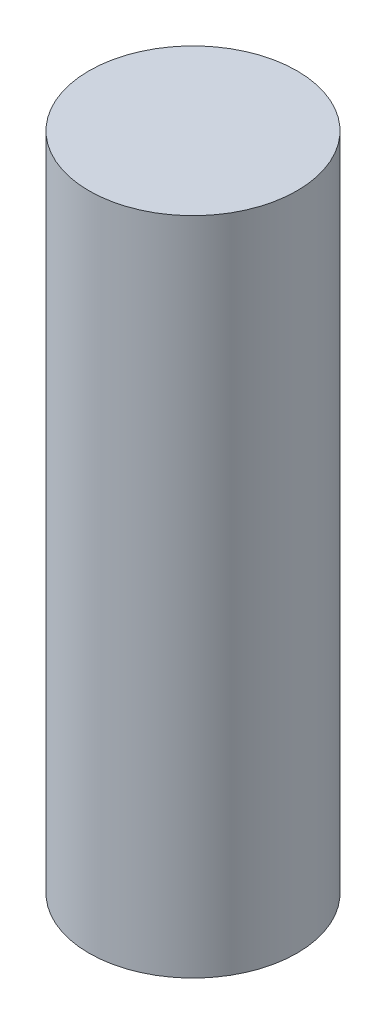
ISO-10303-21;
HEADER;
FILE_DESCRIPTION(('STEP AP214'),'2;1');
FILE_NAME('part.step','',(''),(''),'','','');
FILE_SCHEMA(('AUTOMOTIVE_DESIGN { 1 0 10303 214 1 1 1 1 }'));
ENDSEC;
DATA;
#1=APPLICATION_CONTEXT('core data for automotive mechanical design processes');
#2=APPLICATION_PROTOCOL_DEFINITION('international standard','automotive_design',2000,#1);
#3=PRODUCT_CONTEXT('',#1,'mechanical');
#4=PRODUCT('Part','Part','',(#3));
#5=PRODUCT_RELATED_PRODUCT_CATEGORY('part','',(#4));
#6=PRODUCT_DEFINITION_FORMATION('','',#4);
#7=PRODUCT_DEFINITION_CONTEXT('part definition',#1,'design');
#8=PRODUCT_DEFINITION('design','',#6,#7);
#9=PRODUCT_DEFINITION_SHAPE('','',#8);
#10=(LENGTH_UNIT() NAMED_UNIT(*) SI_UNIT(.MILLI.,.METRE.));
#11=(NAMED_UNIT(*) PLANE_ANGLE_UNIT() SI_UNIT($,.RADIAN.));
#12=(NAMED_UNIT(*) SI_UNIT($,.STERADIAN.) SOLID_ANGLE_UNIT());
#13=UNCERTAINTY_MEASURE_WITH_UNIT(LENGTH_MEASURE(1.E-05),#10,'distance_accuracy_value','');
#14=(GEOMETRIC_REPRESENTATION_CONTEXT(3) GLOBAL_UNCERTAINTY_ASSIGNED_CONTEXT((#13)) GLOBAL_UNIT_ASSIGNED_CONTEXT((#10,
#11,#12)) REPRESENTATION_CONTEXT('',''));
#15=CARTESIAN_POINT('',(0.,0.,0.));
#16=DIRECTION('',(0.,0.,1.));
#17=DIRECTION('',(1.,0.,0.));
#18=AXIS2_PLACEMENT_3D('',#15,#16,#17);
#19=CARTESIAN_POINT('',(0.,12.7,0.));
#20=DIRECTION('',(0.,-1.,0.));
#21=DIRECTION('',(0.,0.,-1.));
#22=AXIS2_PLACEMENT_3D('',#19,#20,#21);
#23=CYLINDRICAL_SURFACE('',#22,2.);
#24=CARTESIAN_POINT('',(0.,12.7,0.));
#25=DIRECTION('',(0.,1.,0.));
#26=DIRECTION('',(0.,0.,1.));
#27=AXIS2_PLACEMENT_3D('',#24,#25,#26);
#28=CIRCLE('',#27,2.);
#29=CARTESIAN_POINT('',(0.,12.7,2.));
#30=VERTEX_POINT('',#29);
#31=EDGE_CURVE('E10',#30,#30,#28,.T.);
#32=ORIENTED_EDGE('',*,*,#31,.F.);
#33=EDGE_LOOP('',(#32));
#34=FACE_BOUND('',#33,.T.);
#35=CARTESIAN_POINT('',(0.,0.,0.));
#36=DIRECTION('',(0.,1.,0.));
#37=DIRECTION('',(0.,0.,1.));
#38=AXIS2_PLACEMENT_3D('',#35,#36,#37);
#39=CIRCLE('',#38,2.);
#40=CARTESIAN_POINT('',(0.,0.,2.));
#41=VERTEX_POINT('',#40);
#42=EDGE_CURVE('E33',#41,#41,#39,.T.);
#43=ORIENTED_EDGE('',*,*,#42,.T.);
#44=EDGE_LOOP('',(#43));
#45=FACE_BOUND('',#44,.T.);
#46=ADVANCED_FACE('F30',(#34,#45),#23,.T.);
#47=CARTESIAN_POINT('',(0.,12.7,0.));
#48=DIRECTION('',(0.,1.,0.));
#49=DIRECTION('',(0.,0.,1.));
#50=AXIS2_PLACEMENT_3D('',#47,#48,#49);
#51=PLANE('',#50);
#52=ORIENTED_EDGE('',*,*,#31,.T.);
#53=EDGE_LOOP('',(#52));
#54=FACE_BOUND('',#53,.T.);
#55=ADVANCED_FACE('F45',(#54),#51,.T.);
#56=CARTESIAN_POINT('',(0.,0.,0.));
#57=DIRECTION('',(0.,1.,0.));
#58=DIRECTION('',(0.,0.,1.));
#59=AXIS2_PLACEMENT_3D('',#56,#57,#58);
#60=PLANE('',#59);
#61=ORIENTED_EDGE('',*,*,#42,.F.);
#62=EDGE_LOOP('',(#61));
#63=FACE_BOUND('',#62,.T.);
#64=ADVANCED_FACE('F43',(#63),#60,.F.);
#65=CLOSED_SHELL('',(#46,#55,#64));
#66=MANIFOLD_SOLID_BREP('B2',#65);
#67=ADVANCED_BREP_SHAPE_REPRESENTATION('',(#18,#66),#14);
#68=SHAPE_DEFINITION_REPRESENTATION(#9,#67);
ENDSEC;
END-ISO-10303-21;
